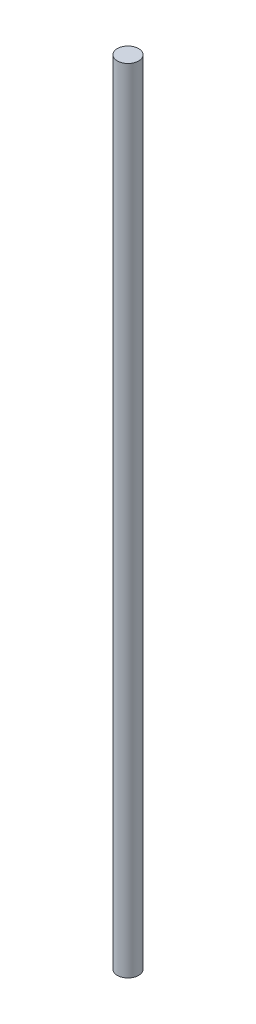
ISO-10303-21;
HEADER;
FILE_DESCRIPTION(('STEP AP214'),'2;1');
FILE_NAME('part.step','',(''),(''),'','','');
FILE_SCHEMA(('AUTOMOTIVE_DESIGN { 1 0 10303 214 1 1 1 1 }'));
ENDSEC;
DATA;
#1=APPLICATION_CONTEXT('core data for automotive mechanical design processes');
#2=APPLICATION_PROTOCOL_DEFINITION('international standard','automotive_design',2000,#1);
#3=PRODUCT_CONTEXT('',#1,'mechanical');
#4=PRODUCT('Part','Part','',(#3));
#5=PRODUCT_RELATED_PRODUCT_CATEGORY('part','',(#4));
#6=PRODUCT_DEFINITION_FORMATION('','',#4);
#7=PRODUCT_DEFINITION_CONTEXT('part definition',#1,'design');
#8=PRODUCT_DEFINITION('design','',#6,#7);
#9=PRODUCT_DEFINITION_SHAPE('','',#8);
#10=(LENGTH_UNIT() NAMED_UNIT(*) SI_UNIT(.MILLI.,.METRE.));
#11=(NAMED_UNIT(*) PLANE_ANGLE_UNIT() SI_UNIT($,.RADIAN.));
#12=(NAMED_UNIT(*) SI_UNIT($,.STERADIAN.) SOLID_ANGLE_UNIT());
#13=UNCERTAINTY_MEASURE_WITH_UNIT(LENGTH_MEASURE(1.E-05),#10,'distance_accuracy_value','');
#14=(GEOMETRIC_REPRESENTATION_CONTEXT(3) GLOBAL_UNCERTAINTY_ASSIGNED_CONTEXT((#13)) GLOBAL_UNIT_ASSIGNED_CONTEXT((#10,
#11,#12)) REPRESENTATION_CONTEXT('',''));
#15=CARTESIAN_POINT('',(0.,0.,0.));
#16=DIRECTION('',(0.,0.,1.));
#17=DIRECTION('',(1.,0.,0.));
#18=AXIS2_PLACEMENT_3D('',#15,#16,#17);
#19=CARTESIAN_POINT('',(0.,111.,0.));
#20=DIRECTION('',(0.,-1.,0.));
#21=DIRECTION('',(0.,0.,-1.));
#22=AXIS2_PLACEMENT_3D('',#19,#20,#21);
#23=CYLINDRICAL_SURFACE('',#22,1.5);
#24=CARTESIAN_POINT('',(0.,111.,0.));
#25=DIRECTION('',(0.,1.,0.));
#26=DIRECTION('',(0.,0.,1.));
#27=AXIS2_PLACEMENT_3D('',#24,#25,#26);
#28=CIRCLE('',#27,1.5);
#29=CARTESIAN_POINT('',(0.,111.,1.5));
#30=VERTEX_POINT('',#29);
#31=EDGE_CURVE('E10',#30,#30,#28,.T.);
#32=ORIENTED_EDGE('',*,*,#31,.F.);
#33=EDGE_LOOP('',(#32));
#34=FACE_BOUND('',#33,.T.);
#35=CARTESIAN_POINT('',(0.,0.,0.));
#36=DIRECTION('',(0.,1.,0.));
#37=DIRECTION('',(0.,0.,1.));
#38=AXIS2_PLACEMENT_3D('',#35,#36,#37);
#39=CIRCLE('',#38,1.5);
#40=CARTESIAN_POINT('',(0.,0.,1.5));
#41=VERTEX_POINT('',#40);
#42=EDGE_CURVE('E34',#41,#41,#39,.T.);
#43=ORIENTED_EDGE('',*,*,#42,.T.);
#44=EDGE_LOOP('',(#43));
#45=FACE_BOUND('',#44,.T.);
#46=ADVANCED_FACE('F31',(#34,#45),#23,.T.);
#47=CARTESIAN_POINT('',(0.,111.,0.));
#48=DIRECTION('',(0.,1.,0.));
#49=DIRECTION('',(0.,0.,1.));
#50=AXIS2_PLACEMENT_3D('',#47,#48,#49);
#51=PLANE('',#50);
#52=ORIENTED_EDGE('',*,*,#31,.T.);
#53=EDGE_LOOP('',(#52));
#54=FACE_BOUND('',#53,.T.);
#55=ADVANCED_FACE('F46',(#54),#51,.T.);
#56=CARTESIAN_POINT('',(0.,0.,0.));
#57=DIRECTION('',(0.,1.,0.));
#58=DIRECTION('',(0.,0.,1.));
#59=AXIS2_PLACEMENT_3D('',#56,#57,#58);
#60=PLANE('',#59);
#61=ORIENTED_EDGE('',*,*,#42,.F.);
#62=EDGE_LOOP('',(#61));
#63=FACE_BOUND('',#62,.T.);
#64=ADVANCED_FACE('F44',(#63),#60,.F.);
#65=CLOSED_SHELL('',(#46,#55,#64));
#66=MANIFOLD_SOLID_BREP('B2',#65);
#67=ADVANCED_BREP_SHAPE_REPRESENTATION('',(#18,#66),#14);
#68=SHAPE_DEFINITION_REPRESENTATION(#9,#67);
ENDSEC;
END-ISO-10303-21;
